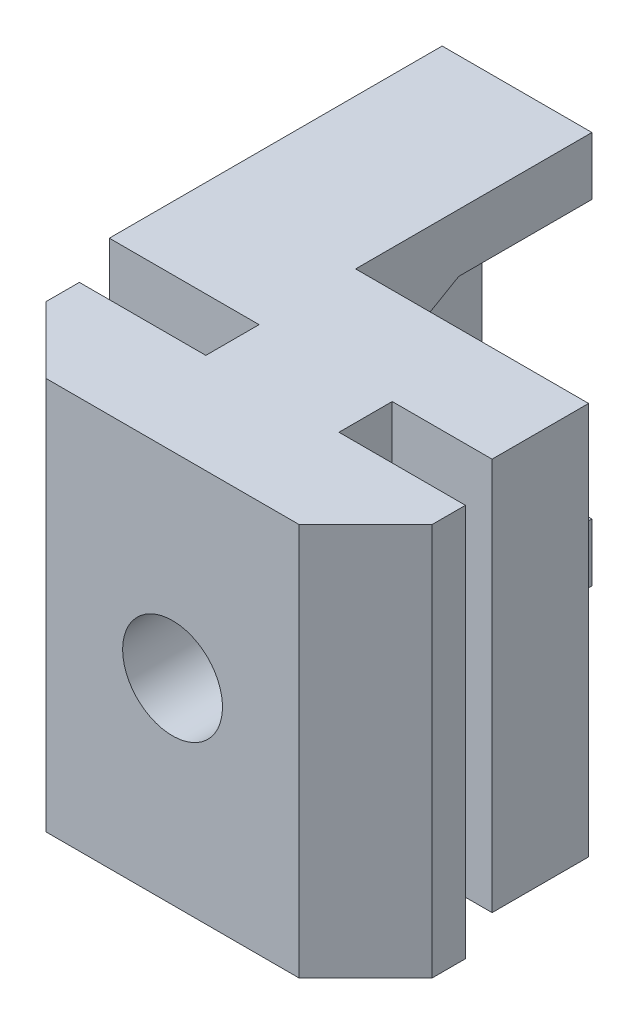
ISO-10303-21;
HEADER;
FILE_DESCRIPTION(('STEP AP214'),'2;1');
FILE_NAME('part.step','',(''),(''),'','','');
FILE_SCHEMA(('AUTOMOTIVE_DESIGN { 1 0 10303 214 1 1 1 1 }'));
ENDSEC;
DATA;
#1=APPLICATION_CONTEXT('core data for automotive mechanical design processes');
#2=APPLICATION_PROTOCOL_DEFINITION('international standard','automotive_design',2000,#1);
#3=PRODUCT_CONTEXT('',#1,'mechanical');
#4=PRODUCT('Part','Part','',(#3));
#5=PRODUCT_RELATED_PRODUCT_CATEGORY('part','',(#4));
#6=PRODUCT_DEFINITION_FORMATION('','',#4);
#7=PRODUCT_DEFINITION_CONTEXT('part definition',#1,'design');
#8=PRODUCT_DEFINITION('design','',#6,#7);
#9=PRODUCT_DEFINITION_SHAPE('','',#8);
#10=(LENGTH_UNIT() NAMED_UNIT(*) SI_UNIT(.MILLI.,.METRE.));
#11=(NAMED_UNIT(*) PLANE_ANGLE_UNIT() SI_UNIT($,.RADIAN.));
#12=(NAMED_UNIT(*) SI_UNIT($,.STERADIAN.) SOLID_ANGLE_UNIT());
#13=UNCERTAINTY_MEASURE_WITH_UNIT(LENGTH_MEASURE(1.E-05),#10,'distance_accuracy_value','');
#14=(GEOMETRIC_REPRESENTATION_CONTEXT(3) GLOBAL_UNCERTAINTY_ASSIGNED_CONTEXT((#13)) GLOBAL_UNIT_ASSIGNED_CONTEXT((#10,
#11,#12)) REPRESENTATION_CONTEXT('',''));
#15=CARTESIAN_POINT('',(0.,0.,0.));
#16=DIRECTION('',(0.,0.,1.));
#17=DIRECTION('',(1.,0.,0.));
#18=AXIS2_PLACEMENT_3D('',#15,#16,#17);
#19=CARTESIAN_POINT('',(-2.,-0.001000000000001,-7.5));
#20=DIRECTION('',(-1.,0.,0.));
#21=DIRECTION('',(0.,0.,1.));
#22=AXIS2_PLACEMENT_3D('',#19,#20,#21);
#23=PLANE('',#22);
#24=DIRECTION('',(0.,1.,0.));
#25=VECTOR('',#24,1.);
#26=CARTESIAN_POINT('',(-2.,-0.001000000000001,-14.6));
#27=LINE('',#26,#25);
#28=CARTESIAN_POINT('',(-2.,16.6569219381653,-14.6));
#29=VERTEX_POINT('',#28);
#30=CARTESIAN_POINT('',(-2.,18.4,-14.6));
#31=VERTEX_POINT('',#30);
#32=EDGE_CURVE('E250',#29,#31,#27,.T.);
#33=ORIENTED_EDGE('',*,*,#32,.T.);
#34=DIRECTION('',(0.,0.,1.));
#35=VECTOR('',#34,1.);
#36=CARTESIAN_POINT('',(-2.,18.4,-7.5));
#37=LINE('',#36,#35);
#38=CARTESIAN_POINT('',(-2.,18.4,-7.5));
#39=VERTEX_POINT('',#38);
#40=EDGE_CURVE('E192',#31,#39,#37,.T.);
#41=ORIENTED_EDGE('',*,*,#40,.T.);
#42=DIRECTION('',(0.,1.,0.));
#43=VECTOR('',#42,1.);
#44=CARTESIAN_POINT('',(-2.,-0.001000000000001,-7.5));
#45=LINE('',#44,#43);
#46=CARTESIAN_POINT('',(-2.,14.8671361036775,-7.5));
#47=VERTEX_POINT('',#46);
#48=EDGE_CURVE('E249',#47,#39,#45,.T.);
#49=ORIENTED_EDGE('',*,*,#48,.F.);
#50=DIRECTION('',(0.,-0.5,0.866025403784438));
#51=VECTOR('',#50,1.);
#52=CARTESIAN_POINT('',(-2.,16.6569219381653,-10.6));
#53=LINE('',#52,#51);
#54=CARTESIAN_POINT('',(-2.,16.6569219381653,-10.6));
#55=VERTEX_POINT('',#54);
#56=EDGE_CURVE('E336',#55,#47,#53,.T.);
#57=ORIENTED_EDGE('',*,*,#56,.F.);
#58=DIRECTION('',(0.,0.,1.));
#59=VECTOR('',#58,1.);
#60=CARTESIAN_POINT('',(-2.,16.6569219381653,-10.6));
#61=LINE('',#60,#59);
#62=EDGE_CURVE('E321',#29,#55,#61,.T.);
#63=ORIENTED_EDGE('',*,*,#62,.F.);
#64=EDGE_LOOP('',(#33,#41,#49,#57,#63));
#65=FACE_BOUND('',#64,.T.);
#66=ADVANCED_FACE('F34',(#65),#23,.F.);
#67=CARTESIAN_POINT('',(-6.5,12.5,-10.6));
#68=DIRECTION('',(-1.,0.,0.));
#69=DIRECTION('',(0.,0.,1.));
#70=AXIS2_PLACEMENT_3D('',#67,#68,#69);
#71=CYLINDRICAL_SURFACE('',#70,2.25);
#72=CARTESIAN_POINT('',(-6.5,12.5,-10.6));
#73=DIRECTION('',(-1.,0.,0.));
#74=DIRECTION('',(0.,0.,1.));
#75=AXIS2_PLACEMENT_3D('',#72,#73,#74);
#76=CIRCLE('',#75,2.25);
#77=CARTESIAN_POINT('',(-6.5,12.5,-8.35));
#78=VERTEX_POINT('',#77);
#79=EDGE_CURVE('E235',#78,#78,#76,.T.);
#80=ORIENTED_EDGE('',*,*,#79,.T.);
#81=EDGE_LOOP('',(#80));
#82=FACE_BOUND('',#81,.T.);
#83=CARTESIAN_POINT('',(-5.3,12.5,-10.6));
#84=DIRECTION('',(1.,0.,0.));
#85=DIRECTION('',(0.,0.,-1.));
#86=AXIS2_PLACEMENT_3D('',#83,#84,#85);
#87=CIRCLE('',#86,2.25);
#88=CARTESIAN_POINT('',(-5.3,12.5,-12.85));
#89=VERTEX_POINT('',#88);
#90=EDGE_CURVE('E233',#89,#89,#87,.F.);
#91=ORIENTED_EDGE('',*,*,#90,.F.);
#92=EDGE_LOOP('',(#91));
#93=FACE_BOUND('',#92,.T.);
#94=ADVANCED_FACE('F460',(#82,#93),#71,.F.);
#95=CARTESIAN_POINT('',(5.,-0.001000000000001,-7.5));
#96=DIRECTION('',(0.,0.,1.));
#97=DIRECTION('',(1.,0.,0.));
#98=AXIS2_PLACEMENT_3D('',#95,#96,#97);
#99=PLANE('',#98);
#100=CARTESIAN_POINT('',(0.,12.5,-7.5));
#101=DIRECTION('',(0.,0.,-1.));
#102=DIRECTION('',(-1.,0.,0.));
#103=AXIS2_PLACEMENT_3D('',#100,#101,#102);
#104=CIRCLE('',#103,1.5);
#105=CARTESIAN_POINT('',(-1.5,12.5,-7.5));
#106=VERTEX_POINT('',#105);
#107=EDGE_CURVE('E366',#106,#106,#104,.T.);
#108=ORIENTED_EDGE('',*,*,#107,.F.);
#109=EDGE_LOOP('',(#108));
#110=FACE_BOUND('',#109,.T.);
#111=ORIENTED_EDGE('',*,*,#48,.T.);
#112=DIRECTION('',(1.,0.,0.));
#113=VECTOR('',#112,1.);
#114=CARTESIAN_POINT('',(5.00000000000001,18.4,-7.5));
#115=LINE('',#114,#113);
#116=CARTESIAN_POINT('',(5.,18.4,-7.5));
#117=VERTEX_POINT('',#116);
#118=EDGE_CURVE('E298',#39,#117,#115,.T.);
#119=ORIENTED_EDGE('',*,*,#118,.T.);
#120=DIRECTION('',(0.,1.,0.));
#121=VECTOR('',#120,1.);
#122=CARTESIAN_POINT('',(5.,-0.001000000000001,-7.5));
#123=LINE('',#122,#121);
#124=CARTESIAN_POINT('',(5.,6.59999999999999,-7.5));
#125=VERTEX_POINT('',#124);
#126=EDGE_CURVE('E372',#125,#117,#123,.T.);
#127=ORIENTED_EDGE('',*,*,#126,.F.);
#128=DIRECTION('',(-1.,0.,0.));
#129=VECTOR('',#128,1.);
#130=CARTESIAN_POINT('',(5.,6.59999999999999,-7.5));
#131=LINE('',#130,#129);
#132=CARTESIAN_POINT('',(-2.,6.6,-7.5));
#133=VERTEX_POINT('',#132);
#134=EDGE_CURVE('E208',#125,#133,#131,.T.);
#135=ORIENTED_EDGE('',*,*,#134,.T.);
#136=CARTESIAN_POINT('',(-2.,10.1328638963225,-7.5));
#137=VERTEX_POINT('',#136);
#138=EDGE_CURVE('E244',#133,#137,#45,.T.);
#139=ORIENTED_EDGE('',*,*,#138,.T.);
#140=DIRECTION('',(0.,1.,0.));
#141=VECTOR('',#140,1.);
#142=CARTESIAN_POINT('',(-2.,-0.001000000000001,-7.5));
#143=LINE('',#142,#141);
#144=EDGE_CURVE('E236',#137,#47,#143,.T.);
#145=ORIENTED_EDGE('',*,*,#144,.T.);
#146=EDGE_LOOP('',(#111,#119,#127,#135,#139,#145));
#147=FACE_BOUND('',#146,.T.);
#148=ADVANCED_FACE('F378',(#110,#147),#99,.F.);
#149=CARTESIAN_POINT('',(3.8,25.,0.));
#150=DIRECTION('',(0.,0.,-1.));
#151=DIRECTION('',(-1.,0.,0.));
#152=AXIS2_PLACEMENT_3D('',#149,#150,#151);
#153=PLANE('',#152);
#154=CARTESIAN_POINT('',(0.,12.5,0.));
#155=DIRECTION('',(0.,0.,-1.));
#156=DIRECTION('',(-1.,0.,0.));
#157=AXIS2_PLACEMENT_3D('',#154,#155,#156);
#158=CIRCLE('',#157,1.5);
#159=CARTESIAN_POINT('',(-1.5,12.5,0.));
#160=VERTEX_POINT('',#159);
#161=EDGE_CURVE('E254',#160,#160,#158,.T.);
#162=ORIENTED_EDGE('',*,*,#161,.T.);
#163=EDGE_LOOP('',(#162));
#164=FACE_BOUND('',#163,.T.);
#165=DIRECTION('',(0.,-1.,0.));
#166=VECTOR('',#165,1.);
#167=CARTESIAN_POINT('',(3.8,25.,0.));
#168=LINE('',#167,#166);
#169=CARTESIAN_POINT('',(3.79999999999999,18.4,0.));
#170=VERTEX_POINT('',#169);
#171=CARTESIAN_POINT('',(3.79999999999999,6.59999999999999,0.));
#172=VERTEX_POINT('',#171);
#173=EDGE_CURVE('E230',#170,#172,#168,.T.);
#174=ORIENTED_EDGE('',*,*,#173,.F.);
#175=DIRECTION('',(-1.,0.,0.));
#176=VECTOR('',#175,1.);
#177=CARTESIAN_POINT('',(-6.49999999999999,18.4,0.));
#178=LINE('',#177,#176);
#179=CARTESIAN_POINT('',(-3.8,18.4,0.));
#180=VERTEX_POINT('',#179);
#181=EDGE_CURVE('E197',#170,#180,#178,.T.);
#182=ORIENTED_EDGE('',*,*,#181,.T.);
#183=DIRECTION('',(0.,-1.,0.));
#184=VECTOR('',#183,1.);
#185=CARTESIAN_POINT('',(-3.8,25.,0.));
#186=LINE('',#185,#184);
#187=CARTESIAN_POINT('',(-3.8,6.6,0.));
#188=VERTEX_POINT('',#187);
#189=EDGE_CURVE('E257',#180,#188,#186,.T.);
#190=ORIENTED_EDGE('',*,*,#189,.T.);
#191=DIRECTION('',(1.,0.,0.));
#192=VECTOR('',#191,1.);
#193=CARTESIAN_POINT('',(5.79999999999999,6.59999999999999,0.));
#194=LINE('',#193,#192);
#195=EDGE_CURVE('E440',#188,#172,#194,.T.);
#196=ORIENTED_EDGE('',*,*,#195,.T.);
#197=EDGE_LOOP('',(#174,#182,#190,#196));
#198=FACE_BOUND('',#197,.T.);
#199=ADVANCED_FACE('F36',(#164,#198),#153,.F.);
#200=CARTESIAN_POINT('',(3.8,25.,0.));
#201=DIRECTION('',(-0.707106781186549,0.,-0.707106781186546));
#202=DIRECTION('',(-0.707106781186546,0.,0.707106781186549));
#203=AXIS2_PLACEMENT_3D('',#200,#201,#202);
#204=PLANE('',#203);
#205=DIRECTION('',(0.,-1.,0.));
#206=VECTOR('',#205,1.);
#207=CARTESIAN_POINT('',(5.8,25.,-2.00000000000001));
#208=LINE('',#207,#206);
#209=CARTESIAN_POINT('',(5.8,18.4,-2.00000000000001));
#210=VERTEX_POINT('',#209);
#211=CARTESIAN_POINT('',(5.79999999999999,6.59999999999999,-2.00000000000001));
#212=VERTEX_POINT('',#211);
#213=EDGE_CURVE('E227',#210,#212,#208,.T.);
#214=ORIENTED_EDGE('',*,*,#213,.F.);
#215=DIRECTION('',(-0.707106781186546,0.,0.707106781186549));
#216=VECTOR('',#215,1.);
#217=CARTESIAN_POINT('',(3.8,18.4,0.));
#218=LINE('',#217,#216);
#219=EDGE_CURVE('E313',#210,#170,#218,.T.);
#220=ORIENTED_EDGE('',*,*,#219,.T.);
#221=ORIENTED_EDGE('',*,*,#173,.T.);
#222=DIRECTION('',(0.707106781186546,0.,-0.707106781186549));
#223=VECTOR('',#222,1.);
#224=CARTESIAN_POINT('',(3.79999999999999,6.59999999999999,0.));
#225=LINE('',#224,#223);
#226=EDGE_CURVE('E283',#172,#212,#225,.T.);
#227=ORIENTED_EDGE('',*,*,#226,.T.);
#228=EDGE_LOOP('',(#214,#220,#221,#227));
#229=FACE_BOUND('',#228,.T.);
#230=ADVANCED_FACE('F486',(#229),#204,.F.);
#231=CARTESIAN_POINT('',(5.8,25.,-2.00000000000001));
#232=DIRECTION('',(-1.,0.,0.));
#233=DIRECTION('',(0.,0.,1.));
#234=AXIS2_PLACEMENT_3D('',#231,#232,#233);
#235=PLANE('',#234);
#236=DIRECTION('',(0.,-1.,0.));
#237=VECTOR('',#236,1.);
#238=CARTESIAN_POINT('',(5.8,25.,-3.00000000000001));
#239=LINE('',#238,#237);
#240=CARTESIAN_POINT('',(5.8,18.4,-3.00000000000001));
#241=VERTEX_POINT('',#240);
#242=CARTESIAN_POINT('',(5.79999999999999,6.59999999999999,-3.00000000000001));
#243=VERTEX_POINT('',#242);
#244=EDGE_CURVE('E224',#241,#243,#239,.T.);
#245=ORIENTED_EDGE('',*,*,#244,.F.);
#246=DIRECTION('',(0.,0.,-1.));
#247=VECTOR('',#246,1.);
#248=CARTESIAN_POINT('',(5.8,18.4,0.));
#249=LINE('',#248,#247);
#250=EDGE_CURVE('E209',#210,#241,#249,.T.);
#251=ORIENTED_EDGE('',*,*,#250,.F.);
#252=ORIENTED_EDGE('',*,*,#213,.T.);
#253=DIRECTION('',(0.,0.,-1.));
#254=VECTOR('',#253,1.);
#255=CARTESIAN_POINT('',(5.79999999999999,6.59999999999999,0.));
#256=LINE('',#255,#254);
#257=EDGE_CURVE('E198',#212,#243,#256,.T.);
#258=ORIENTED_EDGE('',*,*,#257,.T.);
#259=EDGE_LOOP('',(#245,#251,#252,#258));
#260=FACE_BOUND('',#259,.T.);
#261=ADVANCED_FACE('F493',(#260),#235,.F.);
#262=CARTESIAN_POINT('',(5.8,25.,-3.00000000000001));
#263=DIRECTION('',(0.,0.,1.));
#264=DIRECTION('',(1.,0.,0.));
#265=AXIS2_PLACEMENT_3D('',#262,#263,#264);
#266=PLANE('',#265);
#267=DIRECTION('',(0.,-1.,0.));
#268=VECTOR('',#267,1.);
#269=CARTESIAN_POINT('',(1.99999999999999,25.,-3.00000000000001));
#270=LINE('',#269,#268);
#271=CARTESIAN_POINT('',(1.99999999999999,18.4,-3.00000000000001));
#272=VERTEX_POINT('',#271);
#273=CARTESIAN_POINT('',(1.99999999999999,6.59999999999999,-3.00000000000001));
#274=VERTEX_POINT('',#273);
#275=EDGE_CURVE('E216',#272,#274,#270,.T.);
#276=ORIENTED_EDGE('',*,*,#275,.F.);
#277=DIRECTION('',(1.,0.,0.));
#278=VECTOR('',#277,1.);
#279=CARTESIAN_POINT('',(5.79999999999999,18.4,-3.00000000000001));
#280=LINE('',#279,#278);
#281=EDGE_CURVE('E295',#272,#241,#280,.T.);
#282=ORIENTED_EDGE('',*,*,#281,.T.);
#283=ORIENTED_EDGE('',*,*,#244,.T.);
#284=DIRECTION('',(-1.,0.,0.));
#285=VECTOR('',#284,1.);
#286=CARTESIAN_POINT('',(5.79999999999999,6.59999999999999,-3.00000000000001));
#287=LINE('',#286,#285);
#288=EDGE_CURVE('E414',#243,#274,#287,.T.);
#289=ORIENTED_EDGE('',*,*,#288,.T.);
#290=EDGE_LOOP('',(#276,#282,#283,#289));
#291=FACE_BOUND('',#290,.T.);
#292=ADVANCED_FACE('F499',(#291),#266,.F.);
#293=CARTESIAN_POINT('',(1.99999999999999,25.,-3.00000000000001));
#294=DIRECTION('',(-1.,0.,0.));
#295=DIRECTION('',(0.,0.,1.));
#296=AXIS2_PLACEMENT_3D('',#293,#294,#295);
#297=PLANE('',#296);
#298=DIRECTION('',(0.,-1.,0.));
#299=VECTOR('',#298,1.);
#300=CARTESIAN_POINT('',(1.99999999999999,25.,-4.60000000000001));
#301=LINE('',#300,#299);
#302=CARTESIAN_POINT('',(1.99999999999999,18.4,-4.60000000000001));
#303=VERTEX_POINT('',#302);
#304=CARTESIAN_POINT('',(1.99999999999999,6.59999999999999,-4.60000000000001));
#305=VERTEX_POINT('',#304);
#306=EDGE_CURVE('E213',#303,#305,#301,.T.);
#307=ORIENTED_EDGE('',*,*,#306,.F.);
#308=DIRECTION('',(0.,0.,1.));
#309=VECTOR('',#308,1.);
#310=CARTESIAN_POINT('',(1.99999999999999,18.4,-3.00000000000001));
#311=LINE('',#310,#309);
#312=EDGE_CURVE('E292',#303,#272,#311,.T.);
#313=ORIENTED_EDGE('',*,*,#312,.T.);
#314=ORIENTED_EDGE('',*,*,#275,.T.);
#315=DIRECTION('',(0.,0.,-1.));
#316=VECTOR('',#315,1.);
#317=CARTESIAN_POINT('',(1.99999999999999,6.59999999999999,-3.00000000000001));
#318=LINE('',#317,#316);
#319=EDGE_CURVE('E411',#274,#305,#318,.T.);
#320=ORIENTED_EDGE('',*,*,#319,.T.);
#321=EDGE_LOOP('',(#307,#313,#314,#320));
#322=FACE_BOUND('',#321,.T.);
#323=ADVANCED_FACE('F506',(#322),#297,.F.);
#324=CARTESIAN_POINT('',(1.99999999999999,25.,-4.60000000000001));
#325=DIRECTION('',(0.,0.,-1.));
#326=DIRECTION('',(-1.,0.,0.));
#327=AXIS2_PLACEMENT_3D('',#324,#325,#326);
#328=PLANE('',#327);
#329=DIRECTION('',(0.,1.,0.));
#330=VECTOR('',#329,1.);
#331=CARTESIAN_POINT('',(5.,-0.001000000000001,-4.60000000000001));
#332=LINE('',#331,#330);
#333=CARTESIAN_POINT('',(5.,6.59999999999999,-4.60000000000001));
#334=VERTEX_POINT('',#333);
#335=CARTESIAN_POINT('',(5.,18.4,-4.60000000000001));
#336=VERTEX_POINT('',#335);
#337=EDGE_CURVE('E261',#334,#336,#332,.T.);
#338=ORIENTED_EDGE('',*,*,#337,.T.);
#339=DIRECTION('',(-1.,0.,0.));
#340=VECTOR('',#339,1.);
#341=CARTESIAN_POINT('',(1.99999999999999,18.4,-4.60000000000001));
#342=LINE('',#341,#340);
#343=EDGE_CURVE('E49',#336,#303,#342,.T.);
#344=ORIENTED_EDGE('',*,*,#343,.T.);
#345=ORIENTED_EDGE('',*,*,#306,.T.);
#346=DIRECTION('',(1.,0.,0.));
#347=VECTOR('',#346,1.);
#348=CARTESIAN_POINT('',(1.99999999999998,6.59999999999999,-4.60000000000001));
#349=LINE('',#348,#347);
#350=EDGE_CURVE('E409',#305,#334,#349,.T.);
#351=ORIENTED_EDGE('',*,*,#350,.T.);
#352=EDGE_LOOP('',(#338,#344,#345,#351));
#353=FACE_BOUND('',#352,.T.);
#354=ADVANCED_FACE('F407',(#353),#328,.F.);
#355=CARTESIAN_POINT('',(-6.5,25.,-14.6));
#356=DIRECTION('',(0.,0.,1.));
#357=DIRECTION('',(1.,0.,0.));
#358=AXIS2_PLACEMENT_3D('',#355,#356,#357);
#359=PLANE('',#358);
#360=DIRECTION('',(0.,-1.,0.));
#361=VECTOR('',#360,1.);
#362=CARTESIAN_POINT('',(-6.5,25.,-14.6));
#363=LINE('',#362,#361);
#364=CARTESIAN_POINT('',(-6.5,18.4,-14.6));
#365=VERTEX_POINT('',#364);
#366=CARTESIAN_POINT('',(-6.5,6.6,-14.6));
#367=VERTEX_POINT('',#366);
#368=EDGE_CURVE('E205',#365,#367,#363,.T.);
#369=ORIENTED_EDGE('',*,*,#368,.F.);
#370=DIRECTION('',(-1.,0.,0.));
#371=VECTOR('',#370,1.);
#372=CARTESIAN_POINT('',(-6.5,18.4,-14.6));
#373=LINE('',#372,#371);
#374=EDGE_CURVE('E186',#31,#365,#373,.T.);
#375=ORIENTED_EDGE('',*,*,#374,.F.);
#376=ORIENTED_EDGE('',*,*,#32,.F.);
#377=DIRECTION('',(1.,0.,0.));
#378=VECTOR('',#377,1.);
#379=CARTESIAN_POINT('',(-5.3,16.6569219381653,-14.6));
#380=LINE('',#379,#378);
#381=CARTESIAN_POINT('',(-5.3,16.6569219381653,-14.6));
#382=VERTEX_POINT('',#381);
#383=EDGE_CURVE('E352',#382,#29,#380,.T.);
#384=ORIENTED_EDGE('',*,*,#383,.F.);
#385=DIRECTION('',(0.,1.,0.));
#386=VECTOR('',#385,1.);
#387=CARTESIAN_POINT('',(-5.3,16.6569219381653,-14.6));
#388=LINE('',#387,#386);
#389=CARTESIAN_POINT('',(-5.3,8.34307806183469,-14.6));
#390=VERTEX_POINT('',#389);
#391=EDGE_CURVE('E330',#390,#382,#388,.T.);
#392=ORIENTED_EDGE('',*,*,#391,.F.);
#393=DIRECTION('',(1.,0.,0.));
#394=VECTOR('',#393,1.);
#395=CARTESIAN_POINT('',(-5.3,8.34307806183469,-14.6));
#396=LINE('',#395,#394);
#397=CARTESIAN_POINT('',(-2.,8.34307806183469,-14.6));
#398=VERTEX_POINT('',#397);
#399=EDGE_CURVE('E248',#390,#398,#396,.T.);
#400=ORIENTED_EDGE('',*,*,#399,.T.);
#401=CARTESIAN_POINT('',(-2.,6.6,-14.6));
#402=VERTEX_POINT('',#401);
#403=EDGE_CURVE('E241',#402,#398,#27,.T.);
#404=ORIENTED_EDGE('',*,*,#403,.F.);
#405=DIRECTION('',(1.,0.,0.));
#406=VECTOR('',#405,1.);
#407=CARTESIAN_POINT('',(5.79999999999999,6.59999999999999,-14.6));
#408=LINE('',#407,#406);
#409=EDGE_CURVE('E56',#367,#402,#408,.T.);
#410=ORIENTED_EDGE('',*,*,#409,.F.);
#411=EDGE_LOOP('',(#369,#375,#376,#384,#392,#400,#404,#410));
#412=FACE_BOUND('',#411,.T.);
#413=ADVANCED_FACE('F211',(#412),#359,.F.);
#414=CARTESIAN_POINT('',(-6.5,25.,-4.6));
#415=DIRECTION('',(1.,0.,0.));
#416=DIRECTION('',(0.,0.,-1.));
#417=AXIS2_PLACEMENT_3D('',#414,#415,#416);
#418=PLANE('',#417);
#419=ORIENTED_EDGE('',*,*,#79,.F.);
#420=EDGE_LOOP('',(#419));
#421=FACE_BOUND('',#420,.T.);
#422=DIRECTION('',(0.,-1.,0.));
#423=VECTOR('',#422,1.);
#424=CARTESIAN_POINT('',(-6.5,25.,-4.6));
#425=LINE('',#424,#423);
#426=CARTESIAN_POINT('',(-6.49999999999999,18.4,-4.6));
#427=VERTEX_POINT('',#426);
#428=CARTESIAN_POINT('',(-6.5,6.6,-4.6));
#429=VERTEX_POINT('',#428);
#430=EDGE_CURVE('E207',#427,#429,#425,.T.);
#431=ORIENTED_EDGE('',*,*,#430,.F.);
#432=DIRECTION('',(0.,0.,-1.));
#433=VECTOR('',#432,1.);
#434=CARTESIAN_POINT('',(-6.49999999999999,18.4,0.));
#435=LINE('',#434,#433);
#436=EDGE_CURVE('E189',#427,#365,#435,.T.);
#437=ORIENTED_EDGE('',*,*,#436,.T.);
#438=ORIENTED_EDGE('',*,*,#368,.T.);
#439=DIRECTION('',(0.,0.,-1.));
#440=VECTOR('',#439,1.);
#441=CARTESIAN_POINT('',(-6.5,6.6,0.));
#442=LINE('',#441,#440);
#443=EDGE_CURVE('E445',#429,#367,#442,.T.);
#444=ORIENTED_EDGE('',*,*,#443,.F.);
#445=EDGE_LOOP('',(#431,#437,#438,#444));
#446=FACE_BOUND('',#445,.T.);
#447=ADVANCED_FACE('F203',(#421,#446),#418,.F.);
#448=CARTESIAN_POINT('',(-1.99999999999999,25.,-4.6));
#449=DIRECTION('',(0.,0.,-1.));
#450=DIRECTION('',(-1.,0.,0.));
#451=AXIS2_PLACEMENT_3D('',#448,#449,#450);
#452=PLANE('',#451);
#453=DIRECTION('',(0.,-1.,0.));
#454=VECTOR('',#453,1.);
#455=CARTESIAN_POINT('',(-1.99999999999999,25.,-4.6));
#456=LINE('',#455,#454);
#457=CARTESIAN_POINT('',(-1.99999999999999,18.4,-4.6));
#458=VERTEX_POINT('',#457);
#459=CARTESIAN_POINT('',(-1.99999999999999,6.59999999999999,-4.6));
#460=VERTEX_POINT('',#459);
#461=EDGE_CURVE('E218',#458,#460,#456,.T.);
#462=ORIENTED_EDGE('',*,*,#461,.F.);
#463=DIRECTION('',(-1.,0.,0.));
#464=VECTOR('',#463,1.);
#465=CARTESIAN_POINT('',(-2.,18.4,-4.6));
#466=LINE('',#465,#464);
#467=EDGE_CURVE('E281',#458,#427,#466,.T.);
#468=ORIENTED_EDGE('',*,*,#467,.T.);
#469=ORIENTED_EDGE('',*,*,#430,.T.);
#470=DIRECTION('',(1.,0.,0.));
#471=VECTOR('',#470,1.);
#472=CARTESIAN_POINT('',(-2.00000000000001,6.59999999999999,-4.6));
#473=LINE('',#472,#471);
#474=EDGE_CURVE('E282',#429,#460,#473,.T.);
#475=ORIENTED_EDGE('',*,*,#474,.T.);
#476=EDGE_LOOP('',(#462,#468,#469,#475));
#477=FACE_BOUND('',#476,.T.);
#478=ADVANCED_FACE('F280',(#477),#452,.F.);
#479=CARTESIAN_POINT('',(-1.99999999999999,25.,-3.));
#480=DIRECTION('',(1.,0.,0.));
#481=DIRECTION('',(0.,0.,-1.));
#482=AXIS2_PLACEMENT_3D('',#479,#480,#481);
#483=PLANE('',#482);
#484=DIRECTION('',(0.,-1.,0.));
#485=VECTOR('',#484,1.);
#486=CARTESIAN_POINT('',(-1.99999999999999,25.,-3.));
#487=LINE('',#486,#485);
#488=CARTESIAN_POINT('',(-1.99999999999999,18.4,-3.));
#489=VERTEX_POINT('',#488);
#490=CARTESIAN_POINT('',(-1.99999999999999,6.6,-3.));
#491=VERTEX_POINT('',#490);
#492=EDGE_CURVE('E267',#489,#491,#487,.T.);
#493=ORIENTED_EDGE('',*,*,#492,.F.);
#494=DIRECTION('',(0.,0.,-1.));
#495=VECTOR('',#494,1.);
#496=CARTESIAN_POINT('',(-1.99999999999999,18.4,-3.));
#497=LINE('',#496,#495);
#498=EDGE_CURVE('E277',#489,#458,#497,.T.);
#499=ORIENTED_EDGE('',*,*,#498,.T.);
#500=ORIENTED_EDGE('',*,*,#461,.T.);
#501=DIRECTION('',(0.,0.,1.));
#502=VECTOR('',#501,1.);
#503=CARTESIAN_POINT('',(-1.99999999999999,6.59999999999999,-3.));
#504=LINE('',#503,#502);
#505=EDGE_CURVE('E276',#460,#491,#504,.T.);
#506=ORIENTED_EDGE('',*,*,#505,.T.);
#507=EDGE_LOOP('',(#493,#499,#500,#506));
#508=FACE_BOUND('',#507,.T.);
#509=ADVANCED_FACE('F275',(#508),#483,.F.);
#510=CARTESIAN_POINT('',(-5.8,25.,-3.));
#511=DIRECTION('',(0.,0.,1.));
#512=DIRECTION('',(1.,0.,0.));
#513=AXIS2_PLACEMENT_3D('',#510,#511,#512);
#514=PLANE('',#513);
#515=DIRECTION('',(0.,-1.,0.));
#516=VECTOR('',#515,1.);
#517=CARTESIAN_POINT('',(-5.8,25.,-3.));
#518=LINE('',#517,#516);
#519=CARTESIAN_POINT('',(-5.8,18.4,-3.));
#520=VERTEX_POINT('',#519);
#521=CARTESIAN_POINT('',(-5.8,6.6,-3.));
#522=VERTEX_POINT('',#521);
#523=EDGE_CURVE('E264',#520,#522,#518,.T.);
#524=ORIENTED_EDGE('',*,*,#523,.F.);
#525=DIRECTION('',(1.,0.,0.));
#526=VECTOR('',#525,1.);
#527=CARTESIAN_POINT('',(-5.8,18.4,-3.));
#528=LINE('',#527,#526);
#529=EDGE_CURVE('E308',#520,#489,#528,.T.);
#530=ORIENTED_EDGE('',*,*,#529,.T.);
#531=ORIENTED_EDGE('',*,*,#492,.T.);
#532=DIRECTION('',(-1.,0.,0.));
#533=VECTOR('',#532,1.);
#534=CARTESIAN_POINT('',(-5.80000000000001,6.6,-3.));
#535=LINE('',#534,#533);
#536=EDGE_CURVE('E287',#491,#522,#535,.T.);
#537=ORIENTED_EDGE('',*,*,#536,.T.);
#538=EDGE_LOOP('',(#524,#530,#531,#537));
#539=FACE_BOUND('',#538,.T.);
#540=ADVANCED_FACE('F429',(#539),#514,.F.);
#541=CARTESIAN_POINT('',(-5.8,25.,-2.));
#542=DIRECTION('',(1.,0.,0.));
#543=DIRECTION('',(0.,0.,-1.));
#544=AXIS2_PLACEMENT_3D('',#541,#542,#543);
#545=PLANE('',#544);
#546=DIRECTION('',(0.,-1.,0.));
#547=VECTOR('',#546,1.);
#548=CARTESIAN_POINT('',(-5.8,25.,-2.));
#549=LINE('',#548,#547);
#550=CARTESIAN_POINT('',(-5.79999999999999,18.4,-2.));
#551=VERTEX_POINT('',#550);
#552=CARTESIAN_POINT('',(-5.79999999999999,6.6,-2.));
#553=VERTEX_POINT('',#552);
#554=EDGE_CURVE('E260',#551,#553,#549,.T.);
#555=ORIENTED_EDGE('',*,*,#554,.F.);
#556=DIRECTION('',(0.,0.,-1.));
#557=VECTOR('',#556,1.);
#558=CARTESIAN_POINT('',(-5.8,18.4,-2.));
#559=LINE('',#558,#557);
#560=EDGE_CURVE('E305',#551,#520,#559,.T.);
#561=ORIENTED_EDGE('',*,*,#560,.T.);
#562=ORIENTED_EDGE('',*,*,#523,.T.);
#563=DIRECTION('',(0.,0.,1.));
#564=VECTOR('',#563,1.);
#565=CARTESIAN_POINT('',(-5.8,6.6,-2.));
#566=LINE('',#565,#564);
#567=EDGE_CURVE('E424',#522,#553,#566,.T.);
#568=ORIENTED_EDGE('',*,*,#567,.T.);
#569=EDGE_LOOP('',(#555,#561,#562,#568));
#570=FACE_BOUND('',#569,.T.);
#571=ADVANCED_FACE('F432',(#570),#545,.F.);
#572=CARTESIAN_POINT('',(-3.8,25.,0.));
#573=DIRECTION('',(0.707106781186548,0.,-0.707106781186547));
#574=DIRECTION('',(-0.707106781186547,0.,-0.707106781186548));
#575=AXIS2_PLACEMENT_3D('',#572,#573,#574);
#576=PLANE('',#575);
#577=ORIENTED_EDGE('',*,*,#189,.F.);
#578=DIRECTION('',(-0.707106781186547,0.,-0.707106781186548));
#579=VECTOR('',#578,1.);
#580=CARTESIAN_POINT('',(-3.8,18.4,0.));
#581=LINE('',#580,#579);
#582=EDGE_CURVE('E302',#180,#551,#581,.T.);
#583=ORIENTED_EDGE('',*,*,#582,.T.);
#584=ORIENTED_EDGE('',*,*,#554,.T.);
#585=DIRECTION('',(0.707106781186547,0.,0.707106781186548));
#586=VECTOR('',#585,1.);
#587=CARTESIAN_POINT('',(-3.80000000000001,6.6,0.));
#588=LINE('',#587,#586);
#589=EDGE_CURVE('E421',#553,#188,#588,.T.);
#590=ORIENTED_EDGE('',*,*,#589,.T.);
#591=EDGE_LOOP('',(#577,#583,#584,#590));
#592=FACE_BOUND('',#591,.T.);
#593=ADVANCED_FACE('F436',(#592),#576,.F.);
#594=CARTESIAN_POINT('',(5.,-0.001000000000001,-4.60000000000001));
#595=DIRECTION('',(-1.,0.,0.));
#596=DIRECTION('',(0.,0.,1.));
#597=AXIS2_PLACEMENT_3D('',#594,#595,#596);
#598=PLANE('',#597);
#599=ORIENTED_EDGE('',*,*,#126,.T.);
#600=DIRECTION('',(0.,0.,1.));
#601=VECTOR('',#600,1.);
#602=CARTESIAN_POINT('',(5.,18.4,-4.60000000000001));
#603=LINE('',#602,#601);
#604=EDGE_CURVE('E11',#117,#336,#603,.T.);
#605=ORIENTED_EDGE('',*,*,#604,.T.);
#606=ORIENTED_EDGE('',*,*,#337,.F.);
#607=DIRECTION('',(0.,0.,-1.));
#608=VECTOR('',#607,1.);
#609=CARTESIAN_POINT('',(5.,6.59999999999999,-4.60000000000001));
#610=LINE('',#609,#608);
#611=EDGE_CURVE('E412',#334,#125,#610,.T.);
#612=ORIENTED_EDGE('',*,*,#611,.T.);
#613=EDGE_LOOP('',(#599,#605,#606,#612));
#614=FACE_BOUND('',#613,.T.);
#615=ADVANCED_FACE('F404',(#614),#598,.F.);
#616=ORIENTED_EDGE('',*,*,#138,.F.);
#617=DIRECTION('',(0.,0.,-1.));
#618=VECTOR('',#617,1.);
#619=CARTESIAN_POINT('',(-2.,6.6,-7.5));
#620=LINE('',#619,#618);
#621=EDGE_CURVE('E42',#133,#402,#620,.T.);
#622=ORIENTED_EDGE('',*,*,#621,.T.);
#623=ORIENTED_EDGE('',*,*,#403,.T.);
#624=DIRECTION('',(0.,0.,-1.));
#625=VECTOR('',#624,1.);
#626=CARTESIAN_POINT('',(-2.,8.34307806183469,-14.6));
#627=LINE('',#626,#625);
#628=CARTESIAN_POINT('',(-2.,8.34307806183469,-10.6));
#629=VERTEX_POINT('',#628);
#630=EDGE_CURVE('E346',#629,#398,#627,.T.);
#631=ORIENTED_EDGE('',*,*,#630,.F.);
#632=DIRECTION('',(0.,-0.5,-0.866025403784438));
#633=VECTOR('',#632,1.);
#634=CARTESIAN_POINT('',(-2.,10.4215390309173,-7.));
#635=LINE('',#634,#633);
#636=EDGE_CURVE('E342',#137,#629,#635,.T.);
#637=ORIENTED_EDGE('',*,*,#636,.F.);
#638=EDGE_LOOP('',(#616,#622,#623,#631,#637));
#639=FACE_BOUND('',#638,.T.);
#640=ADVANCED_FACE('F239',(#639),#23,.F.);
#641=CARTESIAN_POINT('',(0.,12.5,-7.5));
#642=DIRECTION('',(0.,0.,-1.));
#643=DIRECTION('',(-1.,0.,0.));
#644=AXIS2_PLACEMENT_3D('',#641,#642,#643);
#645=CYLINDRICAL_SURFACE('',#644,1.5);
#646=ORIENTED_EDGE('',*,*,#161,.F.);
#647=EDGE_LOOP('',(#646));
#648=FACE_BOUND('',#647,.T.);
#649=ORIENTED_EDGE('',*,*,#107,.T.);
#650=EDGE_LOOP('',(#649));
#651=FACE_BOUND('',#650,.T.);
#652=ADVANCED_FACE('F470',(#648,#651),#645,.F.);
#653=CARTESIAN_POINT('',(-5.3,0.,0.));
#654=DIRECTION('',(1.,0.,0.));
#655=DIRECTION('',(0.,0.,-1.));
#656=AXIS2_PLACEMENT_3D('',#653,#654,#655);
#657=PLANE('',#656);
#658=DIRECTION('',(0.,-0.5,0.866025403784438));
#659=VECTOR('',#658,1.);
#660=CARTESIAN_POINT('',(-5.3,16.6569219381653,-10.6));
#661=LINE('',#660,#659);
#662=CARTESIAN_POINT('',(-5.3,16.6569219381653,-10.6));
#663=VERTEX_POINT('',#662);
#664=CARTESIAN_POINT('',(-5.3,14.5784609690827,-7.));
#665=VERTEX_POINT('',#664);
#666=EDGE_CURVE('E317',#663,#665,#661,.T.);
#667=ORIENTED_EDGE('',*,*,#666,.T.);
#668=DIRECTION('',(0.,-1.,0.));
#669=VECTOR('',#668,1.);
#670=CARTESIAN_POINT('',(-5.3,14.5784609690827,-7.));
#671=LINE('',#670,#669);
#672=CARTESIAN_POINT('',(-5.3,10.4215390309173,-7.));
#673=VERTEX_POINT('',#672);
#674=EDGE_CURVE('E320',#665,#673,#671,.T.);
#675=ORIENTED_EDGE('',*,*,#674,.T.);
#676=DIRECTION('',(0.,-0.5,-0.866025403784438));
#677=VECTOR('',#676,1.);
#678=CARTESIAN_POINT('',(-5.3,10.4215390309173,-7.));
#679=LINE('',#678,#677);
#680=CARTESIAN_POINT('',(-5.3,8.34307806183469,-10.6));
#681=VERTEX_POINT('',#680);
#682=EDGE_CURVE('E324',#673,#681,#679,.T.);
#683=ORIENTED_EDGE('',*,*,#682,.T.);
#684=DIRECTION('',(0.,0.,-1.));
#685=VECTOR('',#684,1.);
#686=CARTESIAN_POINT('',(-5.3,8.34307806183469,-14.6));
#687=LINE('',#686,#685);
#688=EDGE_CURVE('E327',#681,#390,#687,.T.);
#689=ORIENTED_EDGE('',*,*,#688,.T.);
#690=ORIENTED_EDGE('',*,*,#391,.T.);
#691=DIRECTION('',(0.,0.,1.));
#692=VECTOR('',#691,1.);
#693=CARTESIAN_POINT('',(-5.3,16.6569219381653,-10.6));
#694=LINE('',#693,#692);
#695=EDGE_CURVE('E332',#382,#663,#694,.T.);
#696=ORIENTED_EDGE('',*,*,#695,.T.);
#697=EDGE_LOOP('',(#667,#675,#683,#689,#690,#696));
#698=FACE_BOUND('',#697,.T.);
#699=ORIENTED_EDGE('',*,*,#90,.T.);
#700=EDGE_LOOP('',(#699));
#701=FACE_BOUND('',#700,.T.);
#702=ADVANCED_FACE('F392',(#698,#701),#657,.T.);
#703=CARTESIAN_POINT('',(-2.,0.,0.));
#704=DIRECTION('',(1.,0.,0.));
#705=DIRECTION('',(0.,0.,-1.));
#706=AXIS2_PLACEMENT_3D('',#703,#704,#705);
#707=PLANE('',#706);
#708=CARTESIAN_POINT('',(-2.,10.4215390309173,-7.));
#709=VERTEX_POINT('',#708);
#710=EDGE_CURVE('E343',#709,#137,#635,.T.);
#711=ORIENTED_EDGE('',*,*,#710,.F.);
#712=DIRECTION('',(0.,-1.,0.));
#713=VECTOR('',#712,1.);
#714=CARTESIAN_POINT('',(-2.,14.5784609690827,-7.));
#715=LINE('',#714,#713);
#716=CARTESIAN_POINT('',(-2.,14.5784609690827,-7.));
#717=VERTEX_POINT('',#716);
#718=EDGE_CURVE('E339',#717,#709,#715,.T.);
#719=ORIENTED_EDGE('',*,*,#718,.F.);
#720=EDGE_CURVE('E316',#47,#717,#53,.T.);
#721=ORIENTED_EDGE('',*,*,#720,.F.);
#722=ORIENTED_EDGE('',*,*,#144,.F.);
#723=EDGE_LOOP('',(#711,#719,#721,#722));
#724=FACE_BOUND('',#723,.T.);
#725=ADVANCED_FACE('F386',(#724),#707,.F.);
#726=CARTESIAN_POINT('',(-5.3,16.6569219381653,-10.6));
#727=DIRECTION('',(0.,0.866025403784438,0.5));
#728=DIRECTION('',(0.,-0.5,0.866025403784439));
#729=AXIS2_PLACEMENT_3D('',#726,#727,#728);
#730=PLANE('',#729);
#731=ORIENTED_EDGE('',*,*,#56,.T.);
#732=ORIENTED_EDGE('',*,*,#720,.T.);
#733=DIRECTION('',(1.,0.,0.));
#734=VECTOR('',#733,1.);
#735=CARTESIAN_POINT('',(-5.3,14.5784609690827,-7.));
#736=LINE('',#735,#734);
#737=EDGE_CURVE('E335',#665,#717,#736,.T.);
#738=ORIENTED_EDGE('',*,*,#737,.F.);
#739=ORIENTED_EDGE('',*,*,#666,.F.);
#740=DIRECTION('',(1.,0.,0.));
#741=VECTOR('',#740,1.);
#742=CARTESIAN_POINT('',(-5.3,16.6569219381653,-10.6));
#743=LINE('',#742,#741);
#744=EDGE_CURVE('E350',#663,#55,#743,.T.);
#745=ORIENTED_EDGE('',*,*,#744,.T.);
#746=EDGE_LOOP('',(#731,#732,#738,#739,#745));
#747=FACE_BOUND('',#746,.T.);
#748=ADVANCED_FACE('F398',(#747),#730,.F.);
#749=CARTESIAN_POINT('',(-5.3,16.6569219381653,-10.6));
#750=DIRECTION('',(0.,1.,0.));
#751=DIRECTION('',(0.,0.,1.));
#752=AXIS2_PLACEMENT_3D('',#749,#750,#751);
#753=PLANE('',#752);
#754=ORIENTED_EDGE('',*,*,#62,.T.);
#755=ORIENTED_EDGE('',*,*,#744,.F.);
#756=ORIENTED_EDGE('',*,*,#695,.F.);
#757=ORIENTED_EDGE('',*,*,#383,.T.);
#758=EDGE_LOOP('',(#754,#755,#756,#757));
#759=FACE_BOUND('',#758,.T.);
#760=ADVANCED_FACE('F574',(#759),#753,.F.);
#761=CARTESIAN_POINT('',(-5.3,8.34307806183469,-14.6));
#762=DIRECTION('',(0.,-1.,0.));
#763=DIRECTION('',(0.,0.,-1.));
#764=AXIS2_PLACEMENT_3D('',#761,#762,#763);
#765=PLANE('',#764);
#766=ORIENTED_EDGE('',*,*,#630,.T.);
#767=ORIENTED_EDGE('',*,*,#399,.F.);
#768=ORIENTED_EDGE('',*,*,#688,.F.);
#769=DIRECTION('',(1.,0.,0.));
#770=VECTOR('',#769,1.);
#771=CARTESIAN_POINT('',(-5.3,8.34307806183469,-10.6));
#772=LINE('',#771,#770);
#773=EDGE_CURVE('E355',#681,#629,#772,.T.);
#774=ORIENTED_EDGE('',*,*,#773,.T.);
#775=EDGE_LOOP('',(#766,#767,#768,#774));
#776=FACE_BOUND('',#775,.T.);
#777=ADVANCED_FACE('F388',(#776),#765,.F.);
#778=CARTESIAN_POINT('',(-5.3,10.4215390309173,-7.));
#779=DIRECTION('',(0.,-0.866025403784438,0.5));
#780=DIRECTION('',(0.,-0.5,-0.866025403784439));
#781=AXIS2_PLACEMENT_3D('',#778,#779,#780);
#782=PLANE('',#781);
#783=ORIENTED_EDGE('',*,*,#710,.T.);
#784=ORIENTED_EDGE('',*,*,#636,.T.);
#785=ORIENTED_EDGE('',*,*,#773,.F.);
#786=ORIENTED_EDGE('',*,*,#682,.F.);
#787=DIRECTION('',(1.,0.,0.));
#788=VECTOR('',#787,1.);
#789=CARTESIAN_POINT('',(-5.3,10.4215390309173,-7.));
#790=LINE('',#789,#788);
#791=EDGE_CURVE('E358',#673,#709,#790,.T.);
#792=ORIENTED_EDGE('',*,*,#791,.T.);
#793=EDGE_LOOP('',(#783,#784,#785,#786,#792));
#794=FACE_BOUND('',#793,.T.);
#795=ADVANCED_FACE('F382',(#794),#782,.F.);
#796=CARTESIAN_POINT('',(-5.3,14.5784609690827,-7.));
#797=DIRECTION('',(0.,0.,1.));
#798=DIRECTION('',(1.,0.,0.));
#799=AXIS2_PLACEMENT_3D('',#796,#797,#798);
#800=PLANE('',#799);
#801=ORIENTED_EDGE('',*,*,#718,.T.);
#802=ORIENTED_EDGE('',*,*,#791,.F.);
#803=ORIENTED_EDGE('',*,*,#674,.F.);
#804=ORIENTED_EDGE('',*,*,#737,.T.);
#805=EDGE_LOOP('',(#801,#802,#803,#804));
#806=FACE_BOUND('',#805,.T.);
#807=ADVANCED_FACE('F396',(#806),#800,.F.);
#808=CARTESIAN_POINT('',(5.79999999999999,6.59999999999999,0.));
#809=DIRECTION('',(0.,1.,0.));
#810=DIRECTION('',(-1.,0.,0.));
#811=AXIS2_PLACEMENT_3D('',#808,#809,#810);
#812=PLANE('',#811);
#813=ORIENTED_EDGE('',*,*,#195,.F.);
#814=ORIENTED_EDGE('',*,*,#589,.F.);
#815=ORIENTED_EDGE('',*,*,#567,.F.);
#816=ORIENTED_EDGE('',*,*,#536,.F.);
#817=ORIENTED_EDGE('',*,*,#505,.F.);
#818=ORIENTED_EDGE('',*,*,#474,.F.);
#819=ORIENTED_EDGE('',*,*,#443,.T.);
#820=ORIENTED_EDGE('',*,*,#409,.T.);
#821=ORIENTED_EDGE('',*,*,#621,.F.);
#822=ORIENTED_EDGE('',*,*,#134,.F.);
#823=ORIENTED_EDGE('',*,*,#611,.F.);
#824=ORIENTED_EDGE('',*,*,#350,.F.);
#825=ORIENTED_EDGE('',*,*,#319,.F.);
#826=ORIENTED_EDGE('',*,*,#288,.F.);
#827=ORIENTED_EDGE('',*,*,#257,.F.);
#828=ORIENTED_EDGE('',*,*,#226,.F.);
#829=EDGE_LOOP('',(#813,#814,#815,#816,#817,#818,#819,#820,#821,#822,#823,#824,#825,#826,#827,#828));
#830=FACE_BOUND('',#829,.T.);
#831=ADVANCED_FACE('F449',(#830),#812,.F.);
#832=CARTESIAN_POINT('',(-6.49999999999999,18.4,0.));
#833=DIRECTION('',(0.,-1.,0.));
#834=DIRECTION('',(1.,0.,0.));
#835=AXIS2_PLACEMENT_3D('',#832,#833,#834);
#836=PLANE('',#835);
#837=ORIENTED_EDGE('',*,*,#250,.T.);
#838=ORIENTED_EDGE('',*,*,#281,.F.);
#839=ORIENTED_EDGE('',*,*,#312,.F.);
#840=ORIENTED_EDGE('',*,*,#343,.F.);
#841=ORIENTED_EDGE('',*,*,#604,.F.);
#842=ORIENTED_EDGE('',*,*,#118,.F.);
#843=ORIENTED_EDGE('',*,*,#40,.F.);
#844=ORIENTED_EDGE('',*,*,#374,.T.);
#845=ORIENTED_EDGE('',*,*,#436,.F.);
#846=ORIENTED_EDGE('',*,*,#467,.F.);
#847=ORIENTED_EDGE('',*,*,#498,.F.);
#848=ORIENTED_EDGE('',*,*,#529,.F.);
#849=ORIENTED_EDGE('',*,*,#560,.F.);
#850=ORIENTED_EDGE('',*,*,#582,.F.);
#851=ORIENTED_EDGE('',*,*,#181,.F.);
#852=ORIENTED_EDGE('',*,*,#219,.F.);
#853=EDGE_LOOP('',(#837,#838,#839,#840,#841,#842,#843,#844,#845,#846,#847,#848,#849,#850,#851,#852));
#854=FACE_BOUND('',#853,.T.);
#855=ADVANCED_FACE('F188',(#854),#836,.F.);
#856=CLOSED_SHELL('',(#66,#94,#148,#199,#230,#261,#292,#323,#354,#413,#447,#478,#509,#540,#571,
#593,#615,#640,#652,#702,#725,#748,#760,#777,#795,#807,#831,#855));
#857=MANIFOLD_SOLID_BREP('B2',#856);
#858=ADVANCED_BREP_SHAPE_REPRESENTATION('',(#18,#857),#14);
#859=SHAPE_DEFINITION_REPRESENTATION(#9,#858);
ENDSEC;
END-ISO-10303-21;
